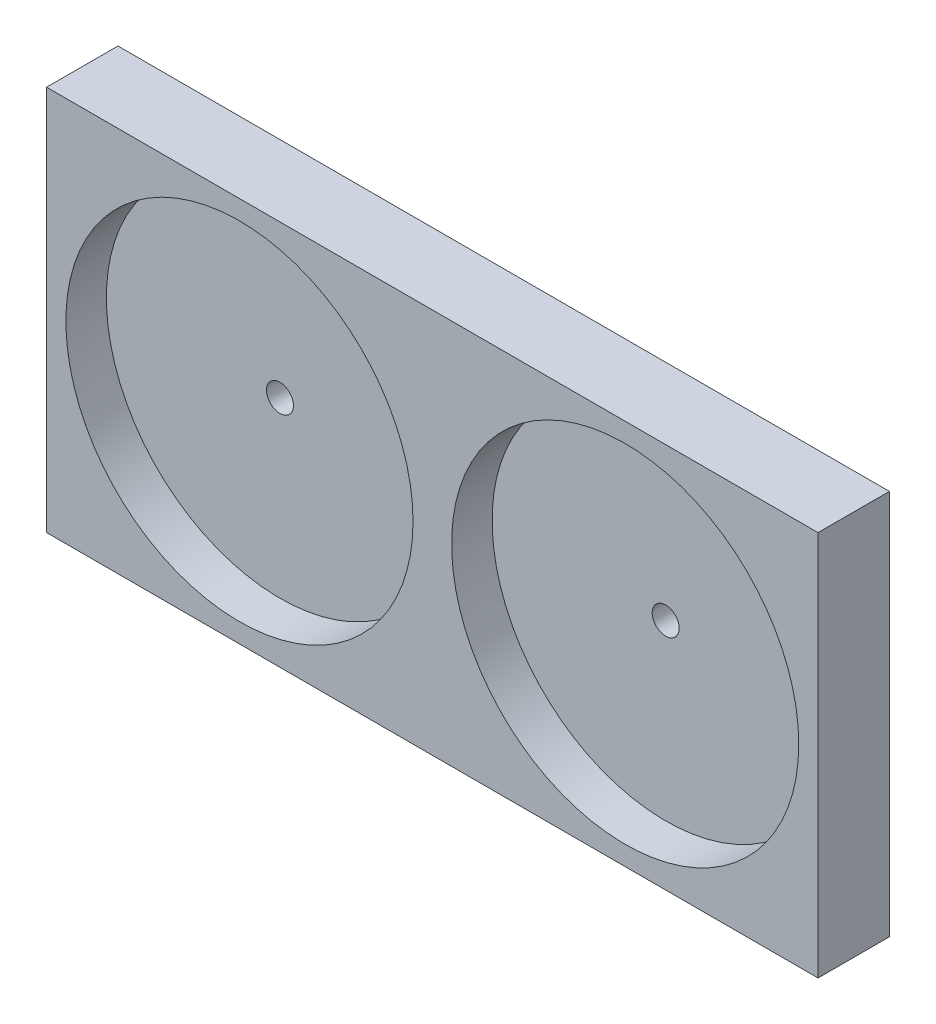
ISO-10303-21;
HEADER;
FILE_DESCRIPTION(('STEP AP214'),'2;1');
FILE_NAME('part.step','',(''),(''),'','','');
FILE_SCHEMA(('AUTOMOTIVE_DESIGN { 1 0 10303 214 1 1 1 1 }'));
ENDSEC;
DATA;
#1=APPLICATION_CONTEXT('core data for automotive mechanical design processes');
#2=APPLICATION_PROTOCOL_DEFINITION('international standard','automotive_design',2000,#1);
#3=PRODUCT_CONTEXT('',#1,'mechanical');
#4=PRODUCT('Part','Part','',(#3));
#5=PRODUCT_RELATED_PRODUCT_CATEGORY('part','',(#4));
#6=PRODUCT_DEFINITION_FORMATION('','',#4);
#7=PRODUCT_DEFINITION_CONTEXT('part definition',#1,'design');
#8=PRODUCT_DEFINITION('design','',#6,#7);
#9=PRODUCT_DEFINITION_SHAPE('','',#8);
#10=(LENGTH_UNIT() NAMED_UNIT(*) SI_UNIT(.MILLI.,.METRE.));
#11=(NAMED_UNIT(*) PLANE_ANGLE_UNIT() SI_UNIT($,.RADIAN.));
#12=(NAMED_UNIT(*) SI_UNIT($,.STERADIAN.) SOLID_ANGLE_UNIT());
#13=UNCERTAINTY_MEASURE_WITH_UNIT(LENGTH_MEASURE(1.E-05),#10,'distance_accuracy_value','');
#14=(GEOMETRIC_REPRESENTATION_CONTEXT(3) GLOBAL_UNCERTAINTY_ASSIGNED_CONTEXT((#13)) GLOBAL_UNIT_ASSIGNED_CONTEXT((#10,
#11,#12)) REPRESENTATION_CONTEXT('',''));
#15=CARTESIAN_POINT('',(0.,0.,0.));
#16=DIRECTION('',(0.,0.,1.));
#17=DIRECTION('',(1.,0.,0.));
#18=AXIS2_PLACEMENT_3D('',#15,#16,#17);
#19=CARTESIAN_POINT('',(0.,0.,0.));
#20=DIRECTION('',(0.,0.,-1.));
#21=DIRECTION('',(-1.,0.,0.));
#22=AXIS2_PLACEMENT_3D('',#19,#20,#21);
#23=PLANE('',#22);
#24=CARTESIAN_POINT('',(150.,50.,0.));
#25=DIRECTION('',(0.,0.,1.));
#26=DIRECTION('',(1.,0.,0.));
#27=AXIS2_PLACEMENT_3D('',#24,#25,#26);
#28=CIRCLE('',#27,3.49999999999999);
#29=CARTESIAN_POINT('',(153.5,50.,0.));
#30=VERTEX_POINT('',#29);
#31=EDGE_CURVE('E355',#30,#30,#28,.T.);
#32=ORIENTED_EDGE('',*,*,#31,.T.);
#33=EDGE_LOOP('',(#32));
#34=FACE_BOUND('',#33,.T.);
#35=DIRECTION('',(0.,1.,0.));
#36=VECTOR('',#35,1.);
#37=CARTESIAN_POINT('',(141.600331897258,55.2961155721941,0.));
#38=LINE('',#37,#36);
#39=CARTESIAN_POINT('',(141.600331897258,25.3942987303045,0.));
#40=VERTEX_POINT('',#39);
#41=CARTESIAN_POINT('',(141.600331897258,55.2961155721941,0.));
#42=VERTEX_POINT('',#41);
#43=EDGE_CURVE('E299',#40,#42,#38,.T.);
#44=ORIENTED_EDGE('',*,*,#43,.T.);
#45=CARTESIAN_POINT('',(150.,55.2961155721941,0.));
#46=DIRECTION('',(0.,0.,-1.));
#47=DIRECTION('',(-1.,0.,0.));
#48=AXIS2_PLACEMENT_3D('',#45,#46,#47);
#49=CIRCLE('',#48,8.39966810274229);
#50=CARTESIAN_POINT('',(158.399668102742,55.2961155721941,0.));
#51=VERTEX_POINT('',#50);
#52=EDGE_CURVE('E309',#42,#51,#49,.T.);
#53=ORIENTED_EDGE('',*,*,#52,.T.);
#54=DIRECTION('',(0.,-1.,0.));
#55=VECTOR('',#54,1.);
#56=CARTESIAN_POINT('',(158.399668102742,55.2961155721941,0.));
#57=LINE('',#56,#55);
#58=CARTESIAN_POINT('',(158.399668102742,25.3942987303045,0.));
#59=VERTEX_POINT('',#58);
#60=EDGE_CURVE('E312',#51,#59,#57,.T.);
#61=ORIENTED_EDGE('',*,*,#60,.T.);
#62=CARTESIAN_POINT('',(150.,25.3942987303045,0.));
#63=DIRECTION('',(0.,0.,-1.));
#64=DIRECTION('',(-1.,0.,0.));
#65=AXIS2_PLACEMENT_3D('',#62,#63,#64);
#66=CIRCLE('',#65,8.39966810274229);
#67=EDGE_CURVE('E316',#59,#40,#66,.T.);
#68=ORIENTED_EDGE('',*,*,#67,.T.);
#69=EDGE_LOOP('',(#44,#53,#61,#68));
#70=FACE_BOUND('',#69,.T.);
#71=ADVANCED_FACE('F39',(#34,#70),#23,.T.);
#72=CARTESIAN_POINT('',(50.,50.,0.));
#73=DIRECTION('',(0.,0.,1.));
#74=DIRECTION('',(1.,0.,0.));
#75=AXIS2_PLACEMENT_3D('',#72,#73,#74);
#76=CIRCLE('',#75,3.5);
#77=CARTESIAN_POINT('',(53.5,50.,0.));
#78=VERTEX_POINT('',#77);
#79=EDGE_CURVE('E425',#78,#78,#76,.T.);
#80=ORIENTED_EDGE('',*,*,#79,.T.);
#81=EDGE_LOOP('',(#80));
#82=FACE_BOUND('',#81,.T.);
#83=DIRECTION('',(0.,1.,0.));
#84=VECTOR('',#83,1.);
#85=CARTESIAN_POINT('',(41.6003318972578,55.2961155721941,0.));
#86=LINE('',#85,#84);
#87=CARTESIAN_POINT('',(41.6003318972578,25.3942987303045,0.));
#88=VERTEX_POINT('',#87);
#89=CARTESIAN_POINT('',(41.6003318972578,55.2961155721941,0.));
#90=VERTEX_POINT('',#89);
#91=EDGE_CURVE('E403',#88,#90,#86,.T.);
#92=ORIENTED_EDGE('',*,*,#91,.T.);
#93=CARTESIAN_POINT('',(50.0000000000001,55.2961155721941,0.));
#94=DIRECTION('',(0.,0.,-1.));
#95=DIRECTION('',(-1.,0.,0.));
#96=AXIS2_PLACEMENT_3D('',#93,#94,#95);
#97=CIRCLE('',#96,8.39966810274229);
#98=CARTESIAN_POINT('',(58.3996681027424,55.2961155721941,0.));
#99=VERTEX_POINT('',#98);
#100=EDGE_CURVE('E313',#90,#99,#97,.T.);
#101=ORIENTED_EDGE('',*,*,#100,.T.);
#102=DIRECTION('',(0.,-1.,0.));
#103=VECTOR('',#102,1.);
#104=CARTESIAN_POINT('',(58.3996681027424,55.2961155721941,0.));
#105=LINE('',#104,#103);
#106=CARTESIAN_POINT('',(58.3996681027424,25.3942987303045,0.));
#107=VERTEX_POINT('',#106);
#108=EDGE_CURVE('E410',#99,#107,#105,.T.);
#109=ORIENTED_EDGE('',*,*,#108,.T.);
#110=CARTESIAN_POINT('',(50.0000000000001,25.3942987303045,0.));
#111=DIRECTION('',(0.,0.,-1.));
#112=DIRECTION('',(-1.,0.,0.));
#113=AXIS2_PLACEMENT_3D('',#110,#111,#112);
#114=CIRCLE('',#113,8.39966810274229);
#115=EDGE_CURVE('E406',#107,#88,#114,.T.);
#116=ORIENTED_EDGE('',*,*,#115,.T.);
#117=EDGE_LOOP('',(#92,#101,#109,#116));
#118=FACE_BOUND('',#117,.T.);
#119=ADVANCED_FACE('F517',(#82,#118),#23,.T.);
#120=CARTESIAN_POINT('',(0.,0.,18.5));
#121=DIRECTION('',(1.,0.,0.));
#122=DIRECTION('',(0.,0.,-1.));
#123=AXIS2_PLACEMENT_3D('',#120,#121,#122);
#124=PLANE('',#123);
#125=DIRECTION('',(0.,-1.,0.));
#126=VECTOR('',#125,1.);
#127=CARTESIAN_POINT('',(0.,0.,0.));
#128=LINE('',#127,#126);
#129=CARTESIAN_POINT('',(0.,100.,0.));
#130=VERTEX_POINT('',#129);
#131=CARTESIAN_POINT('',(0.,0.,0.));
#132=VERTEX_POINT('',#131);
#133=EDGE_CURVE('E434',#130,#132,#128,.T.);
#134=ORIENTED_EDGE('',*,*,#133,.T.);
#135=DIRECTION('',(0.,0.,-1.));
#136=VECTOR('',#135,1.);
#137=CARTESIAN_POINT('',(0.,0.,18.5));
#138=LINE('',#137,#136);
#139=CARTESIAN_POINT('',(0.,0.,18.5));
#140=VERTEX_POINT('',#139);
#141=EDGE_CURVE('E11',#140,#132,#138,.T.);
#142=ORIENTED_EDGE('',*,*,#141,.F.);
#143=DIRECTION('',(0.,-1.,0.));
#144=VECTOR('',#143,1.);
#145=CARTESIAN_POINT('',(0.,0.,18.5));
#146=LINE('',#145,#144);
#147=CARTESIAN_POINT('',(0.,100.,18.5));
#148=VERTEX_POINT('',#147);
#149=EDGE_CURVE('E444',#148,#140,#146,.T.);
#150=ORIENTED_EDGE('',*,*,#149,.F.);
#151=DIRECTION('',(0.,0.,-1.));
#152=VECTOR('',#151,1.);
#153=CARTESIAN_POINT('',(0.,100.,18.5));
#154=LINE('',#153,#152);
#155=EDGE_CURVE('E454',#148,#130,#154,.T.);
#156=ORIENTED_EDGE('',*,*,#155,.T.);
#157=EDGE_LOOP('',(#134,#142,#150,#156));
#158=FACE_BOUND('',#157,.T.);
#159=ADVANCED_FACE('F41',(#158),#124,.F.);
#160=CARTESIAN_POINT('',(0.,0.,18.5));
#161=DIRECTION('',(0.,1.,0.));
#162=DIRECTION('',(0.,0.,1.));
#163=AXIS2_PLACEMENT_3D('',#160,#161,#162);
#164=PLANE('',#163);
#165=DIRECTION('',(1.,0.,0.));
#166=VECTOR('',#165,1.);
#167=CARTESIAN_POINT('',(0.,0.,0.));
#168=LINE('',#167,#166);
#169=CARTESIAN_POINT('',(200.,0.,0.));
#170=VERTEX_POINT('',#169);
#171=EDGE_CURVE('E457',#132,#170,#168,.T.);
#172=ORIENTED_EDGE('',*,*,#171,.T.);
#173=DIRECTION('',(0.,0.,-1.));
#174=VECTOR('',#173,1.);
#175=CARTESIAN_POINT('',(200.,0.,18.5));
#176=LINE('',#175,#174);
#177=CARTESIAN_POINT('',(200.,0.,18.5));
#178=VERTEX_POINT('',#177);
#179=EDGE_CURVE('E48',#178,#170,#176,.T.);
#180=ORIENTED_EDGE('',*,*,#179,.F.);
#181=DIRECTION('',(1.,0.,0.));
#182=VECTOR('',#181,1.);
#183=CARTESIAN_POINT('',(0.,0.,18.5));
#184=LINE('',#183,#182);
#185=EDGE_CURVE('E447',#140,#178,#184,.T.);
#186=ORIENTED_EDGE('',*,*,#185,.F.);
#187=ORIENTED_EDGE('',*,*,#141,.T.);
#188=EDGE_LOOP('',(#172,#180,#186,#187));
#189=FACE_BOUND('',#188,.T.);
#190=ADVANCED_FACE('F505',(#189),#164,.F.);
#191=CARTESIAN_POINT('',(200.,0.,18.5));
#192=DIRECTION('',(-1.,0.,0.));
#193=DIRECTION('',(0.,0.,1.));
#194=AXIS2_PLACEMENT_3D('',#191,#192,#193);
#195=PLANE('',#194);
#196=DIRECTION('',(0.,1.,0.));
#197=VECTOR('',#196,1.);
#198=CARTESIAN_POINT('',(200.,0.,0.));
#199=LINE('',#198,#197);
#200=CARTESIAN_POINT('',(200.,100.,0.));
#201=VERTEX_POINT('',#200);
#202=EDGE_CURVE('E459',#170,#201,#199,.T.);
#203=ORIENTED_EDGE('',*,*,#202,.T.);
#204=DIRECTION('',(0.,0.,-1.));
#205=VECTOR('',#204,1.);
#206=CARTESIAN_POINT('',(200.,100.,18.5));
#207=LINE('',#206,#205);
#208=CARTESIAN_POINT('',(200.,100.,18.5));
#209=VERTEX_POINT('',#208);
#210=EDGE_CURVE('E464',#209,#201,#207,.T.);
#211=ORIENTED_EDGE('',*,*,#210,.F.);
#212=DIRECTION('',(0.,1.,0.));
#213=VECTOR('',#212,1.);
#214=CARTESIAN_POINT('',(200.,0.,18.5));
#215=LINE('',#214,#213);
#216=EDGE_CURVE('E450',#178,#209,#215,.T.);
#217=ORIENTED_EDGE('',*,*,#216,.F.);
#218=ORIENTED_EDGE('',*,*,#179,.T.);
#219=EDGE_LOOP('',(#203,#211,#217,#218));
#220=FACE_BOUND('',#219,.T.);
#221=ADVANCED_FACE('F510',(#220),#195,.F.);
#222=CARTESIAN_POINT('',(0.,100.,18.5));
#223=DIRECTION('',(0.,-1.,0.));
#224=DIRECTION('',(0.,0.,-1.));
#225=AXIS2_PLACEMENT_3D('',#222,#223,#224);
#226=PLANE('',#225);
#227=DIRECTION('',(-1.,0.,0.));
#228=VECTOR('',#227,1.);
#229=CARTESIAN_POINT('',(0.,100.,0.));
#230=LINE('',#229,#228);
#231=EDGE_CURVE('E448',#201,#130,#230,.T.);
#232=ORIENTED_EDGE('',*,*,#231,.T.);
#233=ORIENTED_EDGE('',*,*,#155,.F.);
#234=DIRECTION('',(-1.,0.,0.));
#235=VECTOR('',#234,1.);
#236=CARTESIAN_POINT('',(0.,100.,18.5));
#237=LINE('',#236,#235);
#238=EDGE_CURVE('E452',#209,#148,#237,.T.);
#239=ORIENTED_EDGE('',*,*,#238,.F.);
#240=ORIENTED_EDGE('',*,*,#210,.T.);
#241=EDGE_LOOP('',(#232,#233,#239,#240));
#242=FACE_BOUND('',#241,.T.);
#243=ADVANCED_FACE('F494',(#242),#226,.F.);
#244=CARTESIAN_POINT('',(0.,0.,18.5));
#245=DIRECTION('',(0.,0.,-1.));
#246=DIRECTION('',(-1.,0.,0.));
#247=AXIS2_PLACEMENT_3D('',#244,#245,#246);
#248=PLANE('',#247);
#249=CARTESIAN_POINT('',(50.,50.,18.5));
#250=DIRECTION('',(0.,0.,1.));
#251=DIRECTION('',(1.,0.,0.));
#252=AXIS2_PLACEMENT_3D('',#249,#250,#251);
#253=CIRCLE('',#252,45.);
#254=CARTESIAN_POINT('',(95.,50.,18.5));
#255=VERTEX_POINT('',#254);
#256=EDGE_CURVE('E435',#255,#255,#253,.T.);
#257=ORIENTED_EDGE('',*,*,#256,.F.);
#258=EDGE_LOOP('',(#257));
#259=FACE_BOUND('',#258,.T.);
#260=CARTESIAN_POINT('',(150.,50.,18.5));
#261=DIRECTION('',(0.,0.,1.));
#262=DIRECTION('',(1.,0.,0.));
#263=AXIS2_PLACEMENT_3D('',#260,#261,#262);
#264=CIRCLE('',#263,45.);
#265=CARTESIAN_POINT('',(195.,50.,18.5));
#266=VERTEX_POINT('',#265);
#267=EDGE_CURVE('E438',#266,#266,#264,.T.);
#268=ORIENTED_EDGE('',*,*,#267,.F.);
#269=EDGE_LOOP('',(#268));
#270=FACE_BOUND('',#269,.T.);
#271=ORIENTED_EDGE('',*,*,#149,.T.);
#272=ORIENTED_EDGE('',*,*,#185,.T.);
#273=ORIENTED_EDGE('',*,*,#216,.T.);
#274=ORIENTED_EDGE('',*,*,#238,.T.);
#275=EDGE_LOOP('',(#271,#272,#273,#274));
#276=FACE_BOUND('',#275,.T.);
#277=ADVANCED_FACE('F491',(#259,#270,#276),#248,.F.);
#278=CARTESIAN_POINT('',(110.1200005,30.2499995,0.));
#279=DIRECTION('',(0.,0.,-1.));
#280=DIRECTION('',(-1.,0.,0.));
#281=AXIS2_PLACEMENT_3D('',#278,#279,#280);
#282=CIRCLE('',#281,2.);
#283=CARTESIAN_POINT('',(110.1200005,32.2499995,0.));
#284=VERTEX_POINT('',#283);
#285=CARTESIAN_POINT('',(110.1200005,28.2499995,0.));
#286=VERTEX_POINT('',#285);
#287=EDGE_CURVE('E56',#284,#286,#282,.T.);
#288=ORIENTED_EDGE('',*,*,#287,.F.);
#289=DIRECTION('',(1.,0.,0.));
#290=VECTOR('',#289,1.);
#291=CARTESIAN_POINT('',(110.1200005,32.2499995,0.));
#292=LINE('',#291,#290);
#293=CARTESIAN_POINT('',(89.8000005000001,32.2499995,0.));
#294=VERTEX_POINT('',#293);
#295=EDGE_CURVE('E246',#294,#284,#292,.T.);
#296=ORIENTED_EDGE('',*,*,#295,.F.);
#297=CARTESIAN_POINT('',(89.8000005000001,30.2499995,0.));
#298=DIRECTION('',(0.,0.,-1.));
#299=DIRECTION('',(-1.,0.,0.));
#300=AXIS2_PLACEMENT_3D('',#297,#298,#299);
#301=CIRCLE('',#300,2.);
#302=CARTESIAN_POINT('',(89.8000005000001,28.2499995,0.));
#303=VERTEX_POINT('',#302);
#304=EDGE_CURVE('E249',#303,#294,#301,.T.);
#305=ORIENTED_EDGE('',*,*,#304,.F.);
#306=DIRECTION('',(-1.,0.,0.));
#307=VECTOR('',#306,1.);
#308=CARTESIAN_POINT('',(110.1200005,28.2499995,0.));
#309=LINE('',#308,#307);
#310=EDGE_CURVE('E255',#286,#303,#309,.T.);
#311=ORIENTED_EDGE('',*,*,#310,.F.);
#312=EDGE_LOOP('',(#288,#296,#305,#311));
#313=FACE_BOUND('',#312,.T.);
#314=CARTESIAN_POINT('',(110.1200005,14.9999995,0.));
#315=DIRECTION('',(0.,0.,-1.));
#316=DIRECTION('',(-1.,0.,0.));
#317=AXIS2_PLACEMENT_3D('',#314,#315,#316);
#318=CIRCLE('',#317,2.);
#319=CARTESIAN_POINT('',(110.1200005,16.9999995,0.));
#320=VERTEX_POINT('',#319);
#321=CARTESIAN_POINT('',(110.1200005,12.9999995,0.));
#322=VERTEX_POINT('',#321);
#323=EDGE_CURVE('E64',#320,#322,#318,.T.);
#324=ORIENTED_EDGE('',*,*,#323,.F.);
#325=DIRECTION('',(1.,0.,0.));
#326=VECTOR('',#325,1.);
#327=CARTESIAN_POINT('',(110.1200005,16.9999995,0.));
#328=LINE('',#327,#326);
#329=CARTESIAN_POINT('',(89.8000005000001,16.9999995,0.));
#330=VERTEX_POINT('',#329);
#331=EDGE_CURVE('E274',#330,#320,#328,.T.);
#332=ORIENTED_EDGE('',*,*,#331,.F.);
#333=CARTESIAN_POINT('',(89.8000005000001,14.9999995,0.));
#334=DIRECTION('',(0.,0.,-1.));
#335=DIRECTION('',(-1.,0.,0.));
#336=AXIS2_PLACEMENT_3D('',#333,#334,#335);
#337=CIRCLE('',#336,2.);
#338=CARTESIAN_POINT('',(89.8000005000001,12.9999995,0.));
#339=VERTEX_POINT('',#338);
#340=EDGE_CURVE('E277',#339,#330,#337,.T.);
#341=ORIENTED_EDGE('',*,*,#340,.F.);
#342=DIRECTION('',(-1.,0.,0.));
#343=VECTOR('',#342,1.);
#344=CARTESIAN_POINT('',(110.1200005,12.9999995,0.));
#345=LINE('',#344,#343);
#346=EDGE_CURVE('E281',#322,#339,#345,.T.);
#347=ORIENTED_EDGE('',*,*,#346,.F.);
#348=EDGE_LOOP('',(#324,#332,#341,#347));
#349=FACE_BOUND('',#348,.T.);
#350=CARTESIAN_POINT('',(150.,55.2961155721941,0.));
#351=DIRECTION('',(0.,0.,-1.));
#352=DIRECTION('',(-1.,0.,0.));
#353=AXIS2_PLACEMENT_3D('',#350,#351,#352);
#354=CIRCLE('',#353,16.3996681027423);
#355=CARTESIAN_POINT('',(133.600331897258,55.2961155721941,0.));
#356=VERTEX_POINT('',#355);
#357=CARTESIAN_POINT('',(166.399668102742,55.2961155721941,0.));
#358=VERTEX_POINT('',#357);
#359=EDGE_CURVE('E323',#356,#358,#354,.T.);
#360=ORIENTED_EDGE('',*,*,#359,.F.);
#361=DIRECTION('',(0.,1.,0.));
#362=VECTOR('',#361,1.);
#363=CARTESIAN_POINT('',(133.600331897258,55.2961155721941,0.));
#364=LINE('',#363,#362);
#365=CARTESIAN_POINT('',(133.600331897258,25.3942987303045,0.));
#366=VERTEX_POINT('',#365);
#367=EDGE_CURVE('E334',#366,#356,#364,.T.);
#368=ORIENTED_EDGE('',*,*,#367,.F.);
#369=CARTESIAN_POINT('',(150.,25.3942987303045,0.));
#370=DIRECTION('',(0.,0.,-1.));
#371=DIRECTION('',(-1.,0.,0.));
#372=AXIS2_PLACEMENT_3D('',#369,#370,#371);
#373=CIRCLE('',#372,16.3996681027423);
#374=CARTESIAN_POINT('',(166.399668102742,25.3942987303045,0.));
#375=VERTEX_POINT('',#374);
#376=EDGE_CURVE('E348',#375,#366,#373,.T.);
#377=ORIENTED_EDGE('',*,*,#376,.F.);
#378=DIRECTION('',(0.,-1.,0.));
#379=VECTOR('',#378,1.);
#380=CARTESIAN_POINT('',(166.399668102742,55.2961155721941,0.));
#381=LINE('',#380,#379);
#382=EDGE_CURVE('E345',#358,#375,#381,.T.);
#383=ORIENTED_EDGE('',*,*,#382,.F.);
#384=EDGE_LOOP('',(#360,#368,#377,#383));
#385=FACE_BOUND('',#384,.T.);
#386=CARTESIAN_POINT('',(50.0000000000001,55.2961155721941,0.));
#387=DIRECTION('',(0.,0.,-1.));
#388=DIRECTION('',(-1.,0.,0.));
#389=AXIS2_PLACEMENT_3D('',#386,#387,#388);
#390=CIRCLE('',#389,16.3996681027423);
#391=CARTESIAN_POINT('',(33.6003318972578,55.2961155721941,0.));
#392=VERTEX_POINT('',#391);
#393=CARTESIAN_POINT('',(66.3996681027424,55.2961155721941,0.));
#394=VERTEX_POINT('',#393);
#395=EDGE_CURVE('E381',#392,#394,#390,.T.);
#396=ORIENTED_EDGE('',*,*,#395,.F.);
#397=DIRECTION('',(0.,1.,0.));
#398=VECTOR('',#397,1.);
#399=CARTESIAN_POINT('',(33.6003318972578,55.2961155721941,0.));
#400=LINE('',#399,#398);
#401=CARTESIAN_POINT('',(33.6003318972578,25.3942987303045,0.));
#402=VERTEX_POINT('',#401);
#403=EDGE_CURVE('E371',#402,#392,#400,.T.);
#404=ORIENTED_EDGE('',*,*,#403,.F.);
#405=CARTESIAN_POINT('',(50.0000000000001,25.3942987303045,0.));
#406=DIRECTION('',(0.,0.,-1.));
#407=DIRECTION('',(-1.,0.,0.));
#408=AXIS2_PLACEMENT_3D('',#405,#406,#407);
#409=CIRCLE('',#408,16.3996681027423);
#410=CARTESIAN_POINT('',(66.3996681027424,25.3942987303045,0.));
#411=VERTEX_POINT('',#410);
#412=EDGE_CURVE('E374',#411,#402,#409,.T.);
#413=ORIENTED_EDGE('',*,*,#412,.F.);
#414=DIRECTION('',(0.,-1.,0.));
#415=VECTOR('',#414,1.);
#416=CARTESIAN_POINT('',(66.3996681027424,55.2961155721941,0.));
#417=LINE('',#416,#415);
#418=EDGE_CURVE('E378',#394,#411,#417,.T.);
#419=ORIENTED_EDGE('',*,*,#418,.F.);
#420=EDGE_LOOP('',(#396,#404,#413,#419));
#421=FACE_BOUND('',#420,.T.);
#422=ORIENTED_EDGE('',*,*,#133,.F.);
#423=ORIENTED_EDGE('',*,*,#231,.F.);
#424=ORIENTED_EDGE('',*,*,#202,.F.);
#425=ORIENTED_EDGE('',*,*,#171,.F.);
#426=EDGE_LOOP('',(#422,#423,#424,#425));
#427=FACE_BOUND('',#426,.T.);
#428=ADVANCED_FACE('F487',(#313,#349,#385,#421,#427),#23,.T.);
#429=CARTESIAN_POINT('',(150.,50.,8.));
#430=DIRECTION('',(0.,0.,1.));
#431=DIRECTION('',(1.,0.,0.));
#432=AXIS2_PLACEMENT_3D('',#429,#430,#431);
#433=CYLINDRICAL_SURFACE('',#432,45.);
#434=CARTESIAN_POINT('',(150.,50.,8.));
#435=DIRECTION('',(0.,0.,1.));
#436=DIRECTION('',(1.,0.,0.));
#437=AXIS2_PLACEMENT_3D('',#434,#435,#436);
#438=CIRCLE('',#437,45.);
#439=CARTESIAN_POINT('',(195.,50.,8.));
#440=VERTEX_POINT('',#439);
#441=EDGE_CURVE('E441',#440,#440,#438,.T.);
#442=ORIENTED_EDGE('',*,*,#441,.F.);
#443=EDGE_LOOP('',(#442));
#444=FACE_BOUND('',#443,.T.);
#445=ORIENTED_EDGE('',*,*,#267,.T.);
#446=EDGE_LOOP('',(#445));
#447=FACE_BOUND('',#446,.T.);
#448=ADVANCED_FACE('F481',(#444,#447),#433,.F.);
#449=CARTESIAN_POINT('',(150.,50.,8.));
#450=DIRECTION('',(0.,0.,1.));
#451=DIRECTION('',(1.,0.,0.));
#452=AXIS2_PLACEMENT_3D('',#449,#450,#451);
#453=PLANE('',#452);
#454=CARTESIAN_POINT('',(150.,50.,8.));
#455=DIRECTION('',(0.,0.,1.));
#456=DIRECTION('',(1.,0.,0.));
#457=AXIS2_PLACEMENT_3D('',#454,#455,#456);
#458=CIRCLE('',#457,3.49999999999999);
#459=CARTESIAN_POINT('',(153.5,50.,8.));
#460=VERTEX_POINT('',#459);
#461=EDGE_CURVE('E43',#460,#460,#458,.T.);
#462=ORIENTED_EDGE('',*,*,#461,.F.);
#463=EDGE_LOOP('',(#462));
#464=FACE_BOUND('',#463,.T.);
#465=ORIENTED_EDGE('',*,*,#441,.T.);
#466=EDGE_LOOP('',(#465));
#467=FACE_BOUND('',#466,.T.);
#468=ADVANCED_FACE('F477',(#464,#467),#453,.T.);
#469=CARTESIAN_POINT('',(50.,50.,8.));
#470=DIRECTION('',(0.,0.,1.));
#471=DIRECTION('',(1.,0.,0.));
#472=AXIS2_PLACEMENT_3D('',#469,#470,#471);
#473=CYLINDRICAL_SURFACE('',#472,45.);
#474=CARTESIAN_POINT('',(50.,50.,8.));
#475=DIRECTION('',(0.,0.,1.));
#476=DIRECTION('',(1.,0.,0.));
#477=AXIS2_PLACEMENT_3D('',#474,#475,#476);
#478=CIRCLE('',#477,45.);
#479=CARTESIAN_POINT('',(95.,50.,8.));
#480=VERTEX_POINT('',#479);
#481=EDGE_CURVE('E431',#480,#480,#478,.T.);
#482=ORIENTED_EDGE('',*,*,#481,.F.);
#483=EDGE_LOOP('',(#482));
#484=FACE_BOUND('',#483,.T.);
#485=ORIENTED_EDGE('',*,*,#256,.T.);
#486=EDGE_LOOP('',(#485));
#487=FACE_BOUND('',#486,.T.);
#488=ADVANCED_FACE('F480',(#484,#487),#473,.F.);
#489=CARTESIAN_POINT('',(50.,50.,8.));
#490=DIRECTION('',(0.,0.,1.));
#491=DIRECTION('',(1.,0.,0.));
#492=AXIS2_PLACEMENT_3D('',#489,#490,#491);
#493=PLANE('',#492);
#494=CARTESIAN_POINT('',(50.,50.,8.));
#495=DIRECTION('',(0.,0.,1.));
#496=DIRECTION('',(1.,0.,0.));
#497=AXIS2_PLACEMENT_3D('',#494,#495,#496);
#498=CIRCLE('',#497,3.5);
#499=CARTESIAN_POINT('',(53.5,50.,8.));
#500=VERTEX_POINT('',#499);
#501=EDGE_CURVE('E428',#500,#500,#498,.T.);
#502=ORIENTED_EDGE('',*,*,#501,.F.);
#503=EDGE_LOOP('',(#502));
#504=FACE_BOUND('',#503,.T.);
#505=ORIENTED_EDGE('',*,*,#481,.T.);
#506=EDGE_LOOP('',(#505));
#507=FACE_BOUND('',#506,.T.);
#508=ADVANCED_FACE('F592',(#504,#507),#493,.T.);
#509=CARTESIAN_POINT('',(50.,50.,0.));
#510=DIRECTION('',(0.,0.,1.));
#511=DIRECTION('',(1.,0.,0.));
#512=AXIS2_PLACEMENT_3D('',#509,#510,#511);
#513=CYLINDRICAL_SURFACE('',#512,3.5);
#514=ORIENTED_EDGE('',*,*,#501,.T.);
#515=EDGE_LOOP('',(#514));
#516=FACE_BOUND('',#515,.T.);
#517=ORIENTED_EDGE('',*,*,#79,.F.);
#518=EDGE_LOOP('',(#517));
#519=FACE_BOUND('',#518,.T.);
#520=ADVANCED_FACE('F589',(#516,#519),#513,.F.);
#521=CARTESIAN_POINT('',(150.,50.,0.));
#522=DIRECTION('',(0.,0.,1.));
#523=DIRECTION('',(1.,0.,0.));
#524=AXIS2_PLACEMENT_3D('',#521,#522,#523);
#525=CYLINDRICAL_SURFACE('',#524,3.49999999999999);
#526=ORIENTED_EDGE('',*,*,#461,.T.);
#527=EDGE_LOOP('',(#526));
#528=FACE_BOUND('',#527,.T.);
#529=ORIENTED_EDGE('',*,*,#31,.F.);
#530=EDGE_LOOP('',(#529));
#531=FACE_BOUND('',#530,.T.);
#532=ADVANCED_FACE('F474',(#528,#531),#525,.F.);
#533=CARTESIAN_POINT('',(50.0000000000001,55.2961155721941,3.));
#534=DIRECTION('',(0.,0.,-1.));
#535=DIRECTION('',(-1.,0.,0.));
#536=AXIS2_PLACEMENT_3D('',#533,#534,#535);
#537=CYLINDRICAL_SURFACE('',#536,16.3996681027423);
#538=ORIENTED_EDGE('',*,*,#395,.T.);
#539=DIRECTION('',(0.,0.,-1.));
#540=VECTOR('',#539,1.);
#541=CARTESIAN_POINT('',(66.3996681027424,55.2961155721941,3.));
#542=LINE('',#541,#540);
#543=CARTESIAN_POINT('',(66.3996681027424,55.2961155721941,3.));
#544=VERTEX_POINT('',#543);
#545=EDGE_CURVE('E362',#544,#394,#542,.T.);
#546=ORIENTED_EDGE('',*,*,#545,.F.);
#547=CARTESIAN_POINT('',(50.0000000000001,55.2961155721941,3.));
#548=DIRECTION('',(0.,0.,-1.));
#549=DIRECTION('',(-1.,0.,0.));
#550=AXIS2_PLACEMENT_3D('',#547,#548,#549);
#551=CIRCLE('',#550,16.3996681027423);
#552=CARTESIAN_POINT('',(33.6003318972578,55.2961155721941,3.));
#553=VERTEX_POINT('',#552);
#554=EDGE_CURVE('E375',#553,#544,#551,.T.);
#555=ORIENTED_EDGE('',*,*,#554,.F.);
#556=DIRECTION('',(0.,0.,-1.));
#557=VECTOR('',#556,1.);
#558=CARTESIAN_POINT('',(33.6003318972578,55.2961155721941,3.));
#559=LINE('',#558,#557);
#560=EDGE_CURVE('E261',#553,#392,#559,.T.);
#561=ORIENTED_EDGE('',*,*,#560,.T.);
#562=EDGE_LOOP('',(#538,#546,#555,#561));
#563=FACE_BOUND('',#562,.T.);
#564=ADVANCED_FACE('F559',(#563),#537,.F.);
#565=CARTESIAN_POINT('',(33.6003318972578,55.2961155721941,3.));
#566=DIRECTION('',(-1.,0.,0.));
#567=DIRECTION('',(0.,0.,1.));
#568=AXIS2_PLACEMENT_3D('',#565,#566,#567);
#569=PLANE('',#568);
#570=ORIENTED_EDGE('',*,*,#403,.T.);
#571=ORIENTED_EDGE('',*,*,#560,.F.);
#572=DIRECTION('',(0.,1.,0.));
#573=VECTOR('',#572,1.);
#574=CARTESIAN_POINT('',(33.6003318972578,55.2961155721941,3.));
#575=LINE('',#574,#573);
#576=CARTESIAN_POINT('',(33.6003318972578,25.3942987303045,3.));
#577=VERTEX_POINT('',#576);
#578=EDGE_CURVE('E365',#577,#553,#575,.T.);
#579=ORIENTED_EDGE('',*,*,#578,.F.);
#580=DIRECTION('',(0.,0.,-1.));
#581=VECTOR('',#580,1.);
#582=CARTESIAN_POINT('',(33.6003318972578,25.3942987303045,3.));
#583=LINE('',#582,#581);
#584=EDGE_CURVE('E368',#577,#402,#583,.T.);
#585=ORIENTED_EDGE('',*,*,#584,.T.);
#586=EDGE_LOOP('',(#570,#571,#579,#585));
#587=FACE_BOUND('',#586,.T.);
#588=ADVANCED_FACE('F568',(#587),#569,.F.);
#589=CARTESIAN_POINT('',(50.0000000000001,25.3942987303045,3.));
#590=DIRECTION('',(0.,0.,-1.));
#591=DIRECTION('',(-1.,0.,0.));
#592=AXIS2_PLACEMENT_3D('',#589,#590,#591);
#593=CYLINDRICAL_SURFACE('',#592,16.3996681027423);
#594=ORIENTED_EDGE('',*,*,#412,.T.);
#595=ORIENTED_EDGE('',*,*,#584,.F.);
#596=CARTESIAN_POINT('',(50.0000000000001,25.3942987303045,3.));
#597=DIRECTION('',(0.,0.,-1.));
#598=DIRECTION('',(-1.,0.,0.));
#599=AXIS2_PLACEMENT_3D('',#596,#597,#598);
#600=CIRCLE('',#599,16.3996681027423);
#601=CARTESIAN_POINT('',(66.3996681027424,25.3942987303045,3.));
#602=VERTEX_POINT('',#601);
#603=EDGE_CURVE('E386',#602,#577,#600,.T.);
#604=ORIENTED_EDGE('',*,*,#603,.F.);
#605=DIRECTION('',(0.,0.,-1.));
#606=VECTOR('',#605,1.);
#607=CARTESIAN_POINT('',(66.3996681027424,25.3942987303045,3.));
#608=LINE('',#607,#606);
#609=EDGE_CURVE('E366',#602,#411,#608,.T.);
#610=ORIENTED_EDGE('',*,*,#609,.T.);
#611=EDGE_LOOP('',(#594,#595,#604,#610));
#612=FACE_BOUND('',#611,.T.);
#613=ADVANCED_FACE('F566',(#612),#593,.F.);
#614=CARTESIAN_POINT('',(66.3996681027424,55.2961155721941,3.));
#615=DIRECTION('',(1.,0.,0.));
#616=DIRECTION('',(0.,0.,-1.));
#617=AXIS2_PLACEMENT_3D('',#614,#615,#616);
#618=PLANE('',#617);
#619=ORIENTED_EDGE('',*,*,#418,.T.);
#620=ORIENTED_EDGE('',*,*,#609,.F.);
#621=DIRECTION('',(0.,-1.,0.));
#622=VECTOR('',#621,1.);
#623=CARTESIAN_POINT('',(66.3996681027424,55.2961155721941,3.));
#624=LINE('',#623,#622);
#625=EDGE_CURVE('E389',#544,#602,#624,.T.);
#626=ORIENTED_EDGE('',*,*,#625,.F.);
#627=ORIENTED_EDGE('',*,*,#545,.T.);
#628=EDGE_LOOP('',(#619,#620,#626,#627));
#629=FACE_BOUND('',#628,.T.);
#630=ADVANCED_FACE('F553',(#629),#618,.F.);
#631=CARTESIAN_POINT('',(50.0000000000001,55.2961155721941,3.));
#632=DIRECTION('',(0.,0.,-1.));
#633=DIRECTION('',(-1.,0.,0.));
#634=AXIS2_PLACEMENT_3D('',#631,#632,#633);
#635=PLANE('',#634);
#636=DIRECTION('',(0.,1.,0.));
#637=VECTOR('',#636,1.);
#638=CARTESIAN_POINT('',(41.6003318972578,55.2961155721941,3.));
#639=LINE('',#638,#637);
#640=CARTESIAN_POINT('',(41.6003318972578,25.3942987303045,3.));
#641=VERTEX_POINT('',#640);
#642=CARTESIAN_POINT('',(41.6003318972578,55.2961155721941,3.));
#643=VERTEX_POINT('',#642);
#644=EDGE_CURVE('E396',#641,#643,#639,.T.);
#645=ORIENTED_EDGE('',*,*,#644,.F.);
#646=CARTESIAN_POINT('',(50.0000000000001,25.3942987303045,3.));
#647=DIRECTION('',(0.,0.,-1.));
#648=DIRECTION('',(-1.,0.,0.));
#649=AXIS2_PLACEMENT_3D('',#646,#647,#648);
#650=CIRCLE('',#649,8.39966810274229);
#651=CARTESIAN_POINT('',(58.3996681027424,25.3942987303045,3.));
#652=VERTEX_POINT('',#651);
#653=EDGE_CURVE('E417',#652,#641,#650,.T.);
#654=ORIENTED_EDGE('',*,*,#653,.F.);
#655=DIRECTION('',(0.,-1.,0.));
#656=VECTOR('',#655,1.);
#657=CARTESIAN_POINT('',(58.3996681027424,55.2961155721941,3.));
#658=LINE('',#657,#656);
#659=CARTESIAN_POINT('',(58.3996681027424,55.2961155721941,3.));
#660=VERTEX_POINT('',#659);
#661=EDGE_CURVE('E420',#660,#652,#658,.T.);
#662=ORIENTED_EDGE('',*,*,#661,.F.);
#663=CARTESIAN_POINT('',(50.0000000000001,55.2961155721941,3.));
#664=DIRECTION('',(0.,0.,-1.));
#665=DIRECTION('',(-1.,0.,0.));
#666=AXIS2_PLACEMENT_3D('',#663,#664,#665);
#667=CIRCLE('',#666,8.39966810274229);
#668=EDGE_CURVE('E407',#643,#660,#667,.T.);
#669=ORIENTED_EDGE('',*,*,#668,.F.);
#670=EDGE_LOOP('',(#645,#654,#662,#669));
#671=FACE_BOUND('',#670,.T.);
#672=ORIENTED_EDGE('',*,*,#554,.T.);
#673=ORIENTED_EDGE('',*,*,#625,.T.);
#674=ORIENTED_EDGE('',*,*,#603,.T.);
#675=ORIENTED_EDGE('',*,*,#578,.T.);
#676=EDGE_LOOP('',(#672,#673,#674,#675));
#677=FACE_BOUND('',#676,.T.);
#678=ADVANCED_FACE('F550',(#671,#677),#635,.T.);
#679=CARTESIAN_POINT('',(50.0000000000001,55.2961155721941,3.));
#680=DIRECTION('',(0.,0.,-1.));
#681=DIRECTION('',(-1.,0.,0.));
#682=AXIS2_PLACEMENT_3D('',#679,#680,#681);
#683=CYLINDRICAL_SURFACE('',#682,8.39966810274229);
#684=ORIENTED_EDGE('',*,*,#100,.F.);
#685=DIRECTION('',(0.,0.,-1.));
#686=VECTOR('',#685,1.);
#687=CARTESIAN_POINT('',(41.6003318972578,55.2961155721941,3.));
#688=LINE('',#687,#686);
#689=EDGE_CURVE('E383',#643,#90,#688,.T.);
#690=ORIENTED_EDGE('',*,*,#689,.F.);
#691=ORIENTED_EDGE('',*,*,#668,.T.);
#692=DIRECTION('',(0.,0.,-1.));
#693=VECTOR('',#692,1.);
#694=CARTESIAN_POINT('',(58.3996681027424,55.2961155721941,3.));
#695=LINE('',#694,#693);
#696=EDGE_CURVE('E394',#660,#99,#695,.T.);
#697=ORIENTED_EDGE('',*,*,#696,.T.);
#698=EDGE_LOOP('',(#684,#690,#691,#697));
#699=FACE_BOUND('',#698,.T.);
#700=ADVANCED_FACE('F541',(#699),#683,.T.);
#701=CARTESIAN_POINT('',(41.6003318972578,55.2961155721941,3.));
#702=DIRECTION('',(-1.,0.,0.));
#703=DIRECTION('',(0.,-1.,0.));
#704=AXIS2_PLACEMENT_3D('',#701,#702,#703);
#705=PLANE('',#704);
#706=ORIENTED_EDGE('',*,*,#91,.F.);
#707=DIRECTION('',(0.,0.,-1.));
#708=VECTOR('',#707,1.);
#709=CARTESIAN_POINT('',(41.6003318972578,25.3942987303045,3.));
#710=LINE('',#709,#708);
#711=EDGE_CURVE('E400',#641,#88,#710,.T.);
#712=ORIENTED_EDGE('',*,*,#711,.F.);
#713=ORIENTED_EDGE('',*,*,#644,.T.);
#714=ORIENTED_EDGE('',*,*,#689,.T.);
#715=EDGE_LOOP('',(#706,#712,#713,#714));
#716=FACE_BOUND('',#715,.T.);
#717=ADVANCED_FACE('F537',(#716),#705,.T.);
#718=CARTESIAN_POINT('',(50.0000000000001,25.3942987303045,3.));
#719=DIRECTION('',(0.,0.,-1.));
#720=DIRECTION('',(-1.,0.,0.));
#721=AXIS2_PLACEMENT_3D('',#718,#719,#720);
#722=CYLINDRICAL_SURFACE('',#721,8.39966810274229);
#723=ORIENTED_EDGE('',*,*,#115,.F.);
#724=DIRECTION('',(0.,0.,-1.));
#725=VECTOR('',#724,1.);
#726=CARTESIAN_POINT('',(58.3996681027424,25.3942987303045,3.));
#727=LINE('',#726,#725);
#728=EDGE_CURVE('E397',#652,#107,#727,.T.);
#729=ORIENTED_EDGE('',*,*,#728,.F.);
#730=ORIENTED_EDGE('',*,*,#653,.T.);
#731=ORIENTED_EDGE('',*,*,#711,.T.);
#732=EDGE_LOOP('',(#723,#729,#730,#731));
#733=FACE_BOUND('',#732,.T.);
#734=ADVANCED_FACE('F548',(#733),#722,.T.);
#735=CARTESIAN_POINT('',(58.3996681027424,55.2961155721941,3.));
#736=DIRECTION('',(1.,0.,0.));
#737=DIRECTION('',(0.,1.,0.));
#738=AXIS2_PLACEMENT_3D('',#735,#736,#737);
#739=PLANE('',#738);
#740=ORIENTED_EDGE('',*,*,#108,.F.);
#741=ORIENTED_EDGE('',*,*,#696,.F.);
#742=ORIENTED_EDGE('',*,*,#661,.T.);
#743=ORIENTED_EDGE('',*,*,#728,.T.);
#744=EDGE_LOOP('',(#740,#741,#742,#743));
#745=FACE_BOUND('',#744,.T.);
#746=ADVANCED_FACE('F545',(#745),#739,.T.);
#747=CARTESIAN_POINT('',(150.,55.2961155721941,3.));
#748=DIRECTION('',(0.,0.,-1.));
#749=DIRECTION('',(-1.,0.,0.));
#750=AXIS2_PLACEMENT_3D('',#747,#748,#749);
#751=CYLINDRICAL_SURFACE('',#750,16.3996681027423);
#752=ORIENTED_EDGE('',*,*,#359,.T.);
#753=DIRECTION('',(0.,0.,-1.));
#754=VECTOR('',#753,1.);
#755=CARTESIAN_POINT('',(166.399668102742,55.2961155721941,3.));
#756=LINE('',#755,#754);
#757=CARTESIAN_POINT('',(166.399668102742,55.2961155721941,3.));
#758=VERTEX_POINT('',#757);
#759=EDGE_CURVE('E343',#758,#358,#756,.T.);
#760=ORIENTED_EDGE('',*,*,#759,.F.);
#761=CARTESIAN_POINT('',(150.,55.2961155721941,3.));
#762=DIRECTION('',(0.,0.,-1.));
#763=DIRECTION('',(-1.,0.,0.));
#764=AXIS2_PLACEMENT_3D('',#761,#762,#763);
#765=CIRCLE('',#764,16.3996681027423);
#766=CARTESIAN_POINT('',(133.600331897258,55.2961155721941,3.));
#767=VERTEX_POINT('',#766);
#768=EDGE_CURVE('E330',#767,#758,#765,.T.);
#769=ORIENTED_EDGE('',*,*,#768,.F.);
#770=DIRECTION('',(0.,0.,-1.));
#771=VECTOR('',#770,1.);
#772=CARTESIAN_POINT('',(133.600331897258,55.2961155721941,3.));
#773=LINE('',#772,#771);
#774=EDGE_CURVE('E353',#767,#356,#773,.T.);
#775=ORIENTED_EDGE('',*,*,#774,.T.);
#776=EDGE_LOOP('',(#752,#760,#769,#775));
#777=FACE_BOUND('',#776,.T.);
#778=ADVANCED_FACE('F584',(#777),#751,.F.);
#779=CARTESIAN_POINT('',(133.600331897258,55.2961155721941,3.));
#780=DIRECTION('',(-1.,0.,0.));
#781=DIRECTION('',(0.,0.,1.));
#782=AXIS2_PLACEMENT_3D('',#779,#780,#781);
#783=PLANE('',#782);
#784=ORIENTED_EDGE('',*,*,#367,.T.);
#785=ORIENTED_EDGE('',*,*,#774,.F.);
#786=DIRECTION('',(0.,1.,0.));
#787=VECTOR('',#786,1.);
#788=CARTESIAN_POINT('',(133.600331897258,55.2961155721941,3.));
#789=LINE('',#788,#787);
#790=CARTESIAN_POINT('',(133.600331897258,25.3942987303045,3.));
#791=VERTEX_POINT('',#790);
#792=EDGE_CURVE('E340',#791,#767,#789,.T.);
#793=ORIENTED_EDGE('',*,*,#792,.F.);
#794=DIRECTION('',(0.,0.,-1.));
#795=VECTOR('',#794,1.);
#796=CARTESIAN_POINT('',(133.600331897258,25.3942987303045,3.));
#797=LINE('',#796,#795);
#798=EDGE_CURVE('E356',#791,#366,#797,.T.);
#799=ORIENTED_EDGE('',*,*,#798,.T.);
#800=EDGE_LOOP('',(#784,#785,#793,#799));
#801=FACE_BOUND('',#800,.T.);
#802=ADVANCED_FACE('F689',(#801),#783,.F.);
#803=CARTESIAN_POINT('',(150.,25.3942987303045,3.));
#804=DIRECTION('',(0.,0.,-1.));
#805=DIRECTION('',(-1.,0.,0.));
#806=AXIS2_PLACEMENT_3D('',#803,#804,#805);
#807=CYLINDRICAL_SURFACE('',#806,16.3996681027423);
#808=ORIENTED_EDGE('',*,*,#376,.T.);
#809=ORIENTED_EDGE('',*,*,#798,.F.);
#810=CARTESIAN_POINT('',(150.,25.3942987303045,3.));
#811=DIRECTION('',(0.,0.,-1.));
#812=DIRECTION('',(-1.,0.,0.));
#813=AXIS2_PLACEMENT_3D('',#810,#811,#812);
#814=CIRCLE('',#813,16.3996681027423);
#815=CARTESIAN_POINT('',(166.399668102742,25.3942987303045,3.));
#816=VERTEX_POINT('',#815);
#817=EDGE_CURVE('E337',#816,#791,#814,.T.);
#818=ORIENTED_EDGE('',*,*,#817,.F.);
#819=DIRECTION('',(0.,0.,-1.));
#820=VECTOR('',#819,1.);
#821=CARTESIAN_POINT('',(166.399668102742,25.3942987303045,3.));
#822=LINE('',#821,#820);
#823=EDGE_CURVE('E358',#816,#375,#822,.T.);
#824=ORIENTED_EDGE('',*,*,#823,.T.);
#825=EDGE_LOOP('',(#808,#809,#818,#824));
#826=FACE_BOUND('',#825,.T.);
#827=ADVANCED_FACE('F698',(#826),#807,.F.);
#828=CARTESIAN_POINT('',(166.399668102742,55.2961155721941,3.));
#829=DIRECTION('',(1.,0.,0.));
#830=DIRECTION('',(0.,0.,-1.));
#831=AXIS2_PLACEMENT_3D('',#828,#829,#830);
#832=PLANE('',#831);
#833=ORIENTED_EDGE('',*,*,#382,.T.);
#834=ORIENTED_EDGE('',*,*,#823,.F.);
#835=DIRECTION('',(0.,-1.,0.));
#836=VECTOR('',#835,1.);
#837=CARTESIAN_POINT('',(166.399668102742,55.2961155721941,3.));
#838=LINE('',#837,#836);
#839=EDGE_CURVE('E333',#758,#816,#838,.T.);
#840=ORIENTED_EDGE('',*,*,#839,.F.);
#841=ORIENTED_EDGE('',*,*,#759,.T.);
#842=EDGE_LOOP('',(#833,#834,#840,#841));
#843=FACE_BOUND('',#842,.T.);
#844=ADVANCED_FACE('F707',(#843),#832,.F.);
#845=CARTESIAN_POINT('',(150.,55.2961155721941,3.));
#846=DIRECTION('',(0.,0.,-1.));
#847=DIRECTION('',(-1.,0.,0.));
#848=AXIS2_PLACEMENT_3D('',#845,#846,#847);
#849=PLANE('',#848);
#850=DIRECTION('',(0.,1.,0.));
#851=VECTOR('',#850,1.);
#852=CARTESIAN_POINT('',(141.600331897258,55.2961155721941,3.));
#853=LINE('',#852,#851);
#854=CARTESIAN_POINT('',(141.600331897258,25.3942987303045,3.));
#855=VERTEX_POINT('',#854);
#856=CARTESIAN_POINT('',(141.600331897258,55.2961155721941,3.));
#857=VERTEX_POINT('',#856);
#858=EDGE_CURVE('E305',#855,#857,#853,.T.);
#859=ORIENTED_EDGE('',*,*,#858,.F.);
#860=CARTESIAN_POINT('',(150.,25.3942987303045,3.));
#861=DIRECTION('',(0.,0.,-1.));
#862=DIRECTION('',(-1.,0.,0.));
#863=AXIS2_PLACEMENT_3D('',#860,#861,#862);
#864=CIRCLE('',#863,8.39966810274229);
#865=CARTESIAN_POINT('',(158.399668102742,25.3942987303045,3.));
#866=VERTEX_POINT('',#865);
#867=EDGE_CURVE('E302',#866,#855,#864,.T.);
#868=ORIENTED_EDGE('',*,*,#867,.F.);
#869=DIRECTION('',(0.,-1.,0.));
#870=VECTOR('',#869,1.);
#871=CARTESIAN_POINT('',(158.399668102742,55.2961155721941,3.));
#872=LINE('',#871,#870);
#873=CARTESIAN_POINT('',(158.399668102742,55.2961155721941,3.));
#874=VERTEX_POINT('',#873);
#875=EDGE_CURVE('E298',#874,#866,#872,.T.);
#876=ORIENTED_EDGE('',*,*,#875,.F.);
#877=CARTESIAN_POINT('',(150.,55.2961155721941,3.));
#878=DIRECTION('',(0.,0.,-1.));
#879=DIRECTION('',(-1.,0.,0.));
#880=AXIS2_PLACEMENT_3D('',#877,#878,#879);
#881=CIRCLE('',#880,8.39966810274229);
#882=EDGE_CURVE('E295',#857,#874,#881,.T.);
#883=ORIENTED_EDGE('',*,*,#882,.F.);
#884=EDGE_LOOP('',(#859,#868,#876,#883));
#885=FACE_BOUND('',#884,.T.);
#886=ORIENTED_EDGE('',*,*,#768,.T.);
#887=ORIENTED_EDGE('',*,*,#839,.T.);
#888=ORIENTED_EDGE('',*,*,#817,.T.);
#889=ORIENTED_EDGE('',*,*,#792,.T.);
#890=EDGE_LOOP('',(#886,#887,#888,#889));
#891=FACE_BOUND('',#890,.T.);
#892=ADVANCED_FACE('F716',(#885,#891),#849,.T.);
#893=CARTESIAN_POINT('',(150.,55.2961155721941,3.));
#894=DIRECTION('',(0.,0.,-1.));
#895=DIRECTION('',(-1.,0.,0.));
#896=AXIS2_PLACEMENT_3D('',#893,#894,#895);
#897=CYLINDRICAL_SURFACE('',#896,8.39966810274229);
#898=ORIENTED_EDGE('',*,*,#52,.F.);
#899=DIRECTION('',(0.,0.,-1.));
#900=VECTOR('',#899,1.);
#901=CARTESIAN_POINT('',(141.600331897258,55.2961155721941,3.));
#902=LINE('',#901,#900);
#903=EDGE_CURVE('E321',#857,#42,#902,.T.);
#904=ORIENTED_EDGE('',*,*,#903,.F.);
#905=ORIENTED_EDGE('',*,*,#882,.T.);
#906=DIRECTION('',(0.,0.,-1.));
#907=VECTOR('',#906,1.);
#908=CARTESIAN_POINT('',(158.399668102742,55.2961155721941,3.));
#909=LINE('',#908,#907);
#910=EDGE_CURVE('E308',#874,#51,#909,.T.);
#911=ORIENTED_EDGE('',*,*,#910,.T.);
#912=EDGE_LOOP('',(#898,#904,#905,#911));
#913=FACE_BOUND('',#912,.T.);
#914=ADVANCED_FACE('F725',(#913),#897,.T.);
#915=CARTESIAN_POINT('',(141.600331897258,55.2961155721941,3.));
#916=DIRECTION('',(-1.,0.,0.));
#917=DIRECTION('',(0.,0.,1.));
#918=AXIS2_PLACEMENT_3D('',#915,#916,#917);
#919=PLANE('',#918);
#920=ORIENTED_EDGE('',*,*,#43,.F.);
#921=DIRECTION('',(0.,0.,-1.));
#922=VECTOR('',#921,1.);
#923=CARTESIAN_POINT('',(141.600331897258,25.3942987303045,3.));
#924=LINE('',#923,#922);
#925=EDGE_CURVE('E324',#855,#40,#924,.T.);
#926=ORIENTED_EDGE('',*,*,#925,.F.);
#927=ORIENTED_EDGE('',*,*,#858,.T.);
#928=ORIENTED_EDGE('',*,*,#903,.T.);
#929=EDGE_LOOP('',(#920,#926,#927,#928));
#930=FACE_BOUND('',#929,.T.);
#931=ADVANCED_FACE('F734',(#930),#919,.T.);
#932=CARTESIAN_POINT('',(150.,25.3942987303045,3.));
#933=DIRECTION('',(0.,0.,-1.));
#934=DIRECTION('',(-1.,0.,0.));
#935=AXIS2_PLACEMENT_3D('',#932,#933,#934);
#936=CYLINDRICAL_SURFACE('',#935,8.39966810274229);
#937=ORIENTED_EDGE('',*,*,#67,.F.);
#938=DIRECTION('',(0.,0.,-1.));
#939=VECTOR('',#938,1.);
#940=CARTESIAN_POINT('',(158.399668102742,25.3942987303045,3.));
#941=LINE('',#940,#939);
#942=EDGE_CURVE('E326',#866,#59,#941,.T.);
#943=ORIENTED_EDGE('',*,*,#942,.F.);
#944=ORIENTED_EDGE('',*,*,#867,.T.);
#945=ORIENTED_EDGE('',*,*,#925,.T.);
#946=EDGE_LOOP('',(#937,#943,#944,#945));
#947=FACE_BOUND('',#946,.T.);
#948=ADVANCED_FACE('F743',(#947),#936,.T.);
#949=CARTESIAN_POINT('',(158.399668102742,55.2961155721941,3.));
#950=DIRECTION('',(1.,0.,0.));
#951=DIRECTION('',(0.,0.,-1.));
#952=AXIS2_PLACEMENT_3D('',#949,#950,#951);
#953=PLANE('',#952);
#954=ORIENTED_EDGE('',*,*,#60,.F.);
#955=ORIENTED_EDGE('',*,*,#910,.F.);
#956=ORIENTED_EDGE('',*,*,#875,.T.);
#957=ORIENTED_EDGE('',*,*,#942,.T.);
#958=EDGE_LOOP('',(#954,#955,#956,#957));
#959=FACE_BOUND('',#958,.T.);
#960=ADVANCED_FACE('F752',(#959),#953,.T.);
#961=CARTESIAN_POINT('',(110.1200005,14.9999995,2.));
#962=DIRECTION('',(0.,0.,-1.));
#963=DIRECTION('',(-1.,0.,0.));
#964=AXIS2_PLACEMENT_3D('',#961,#962,#963);
#965=CYLINDRICAL_SURFACE('',#964,2.);
#966=ORIENTED_EDGE('',*,*,#323,.T.);
#967=DIRECTION('',(0.,0.,-1.));
#968=VECTOR('',#967,1.);
#969=CARTESIAN_POINT('',(110.1200005,12.9999995,2.));
#970=LINE('',#969,#968);
#971=CARTESIAN_POINT('',(110.1200005,12.9999995,2.));
#972=VERTEX_POINT('',#971);
#973=EDGE_CURVE('E265',#972,#322,#970,.T.);
#974=ORIENTED_EDGE('',*,*,#973,.F.);
#975=CARTESIAN_POINT('',(110.1200005,14.9999995,2.));
#976=DIRECTION('',(0.,0.,-1.));
#977=DIRECTION('',(-1.,0.,0.));
#978=AXIS2_PLACEMENT_3D('',#975,#976,#977);
#979=CIRCLE('',#978,2.);
#980=CARTESIAN_POINT('',(110.1200005,16.9999995,2.));
#981=VERTEX_POINT('',#980);
#982=EDGE_CURVE('E278',#981,#972,#979,.T.);
#983=ORIENTED_EDGE('',*,*,#982,.F.);
#984=DIRECTION('',(0.,0.,-1.));
#985=VECTOR('',#984,1.);
#986=CARTESIAN_POINT('',(110.1200005,16.9999995,2.));
#987=LINE('',#986,#985);
#988=EDGE_CURVE('E272',#981,#320,#987,.T.);
#989=ORIENTED_EDGE('',*,*,#988,.T.);
#990=EDGE_LOOP('',(#966,#974,#983,#989));
#991=FACE_BOUND('',#990,.T.);
#992=ADVANCED_FACE('F760',(#991),#965,.F.);
#993=CARTESIAN_POINT('',(110.1200005,16.9999995,2.));
#994=DIRECTION('',(0.,1.,0.));
#995=DIRECTION('',(0.,0.,1.));
#996=AXIS2_PLACEMENT_3D('',#993,#994,#995);
#997=PLANE('',#996);
#998=ORIENTED_EDGE('',*,*,#331,.T.);
#999=ORIENTED_EDGE('',*,*,#988,.F.);
#1000=DIRECTION('',(1.,0.,0.));
#1001=VECTOR('',#1000,1.);
#1002=CARTESIAN_POINT('',(110.1200005,16.9999995,2.));
#1003=LINE('',#1002,#1001);
#1004=CARTESIAN_POINT('',(89.8000005000001,16.9999995,2.));
#1005=VERTEX_POINT('',#1004);
#1006=EDGE_CURVE('E267',#1005,#981,#1003,.T.);
#1007=ORIENTED_EDGE('',*,*,#1006,.F.);
#1008=DIRECTION('',(0.,0.,-1.));
#1009=VECTOR('',#1008,1.);
#1010=CARTESIAN_POINT('',(89.8000005000001,16.9999995,2.));
#1011=LINE('',#1010,#1009);
#1012=EDGE_CURVE('E270',#1005,#330,#1011,.T.);
#1013=ORIENTED_EDGE('',*,*,#1012,.T.);
#1014=EDGE_LOOP('',(#998,#999,#1007,#1013));
#1015=FACE_BOUND('',#1014,.T.);
#1016=ADVANCED_FACE('F768',(#1015),#997,.F.);
#1017=CARTESIAN_POINT('',(89.8000005000001,14.9999995,2.));
#1018=DIRECTION('',(0.,0.,-1.));
#1019=DIRECTION('',(-1.,0.,0.));
#1020=AXIS2_PLACEMENT_3D('',#1017,#1018,#1019);
#1021=CYLINDRICAL_SURFACE('',#1020,2.);
#1022=ORIENTED_EDGE('',*,*,#340,.T.);
#1023=ORIENTED_EDGE('',*,*,#1012,.F.);
#1024=CARTESIAN_POINT('',(89.8000005000001,14.9999995,2.));
#1025=DIRECTION('',(0.,0.,-1.));
#1026=DIRECTION('',(-1.,0.,0.));
#1027=AXIS2_PLACEMENT_3D('',#1024,#1025,#1026);
#1028=CIRCLE('',#1027,2.);
#1029=CARTESIAN_POINT('',(89.8000005000001,12.9999995,2.));
#1030=VERTEX_POINT('',#1029);
#1031=EDGE_CURVE('E287',#1030,#1005,#1028,.T.);
#1032=ORIENTED_EDGE('',*,*,#1031,.F.);
#1033=DIRECTION('',(0.,0.,-1.));
#1034=VECTOR('',#1033,1.);
#1035=CARTESIAN_POINT('',(89.8000005000001,12.9999995,2.));
#1036=LINE('',#1035,#1034);
#1037=EDGE_CURVE('E268',#1030,#339,#1036,.T.);
#1038=ORIENTED_EDGE('',*,*,#1037,.T.);
#1039=EDGE_LOOP('',(#1022,#1023,#1032,#1038));
#1040=FACE_BOUND('',#1039,.T.);
#1041=ADVANCED_FACE('F776',(#1040),#1021,.F.);
#1042=CARTESIAN_POINT('',(110.1200005,12.9999995,2.));
#1043=DIRECTION('',(0.,-1.,0.));
#1044=DIRECTION('',(0.,0.,-1.));
#1045=AXIS2_PLACEMENT_3D('',#1042,#1043,#1044);
#1046=PLANE('',#1045);
#1047=ORIENTED_EDGE('',*,*,#346,.T.);
#1048=ORIENTED_EDGE('',*,*,#1037,.F.);
#1049=DIRECTION('',(-1.,0.,0.));
#1050=VECTOR('',#1049,1.);
#1051=CARTESIAN_POINT('',(110.1200005,12.9999995,2.));
#1052=LINE('',#1051,#1050);
#1053=EDGE_CURVE('E290',#972,#1030,#1052,.T.);
#1054=ORIENTED_EDGE('',*,*,#1053,.F.);
#1055=ORIENTED_EDGE('',*,*,#973,.T.);
#1056=EDGE_LOOP('',(#1047,#1048,#1054,#1055));
#1057=FACE_BOUND('',#1056,.T.);
#1058=ADVANCED_FACE('F785',(#1057),#1046,.F.);
#1059=CARTESIAN_POINT('',(110.1200005,14.9999995,2.));
#1060=DIRECTION('',(0.,0.,-1.));
#1061=DIRECTION('',(-1.,0.,0.));
#1062=AXIS2_PLACEMENT_3D('',#1059,#1060,#1061);
#1063=PLANE('',#1062);
#1064=ORIENTED_EDGE('',*,*,#982,.T.);
#1065=ORIENTED_EDGE('',*,*,#1053,.T.);
#1066=ORIENTED_EDGE('',*,*,#1031,.T.);
#1067=ORIENTED_EDGE('',*,*,#1006,.T.);
#1068=EDGE_LOOP('',(#1064,#1065,#1066,#1067));
#1069=FACE_BOUND('',#1068,.T.);
#1070=ADVANCED_FACE('F794',(#1069),#1063,.T.);
#1071=CARTESIAN_POINT('',(110.1200005,30.2499995,2.));
#1072=DIRECTION('',(0.,0.,-1.));
#1073=DIRECTION('',(-1.,0.,0.));
#1074=AXIS2_PLACEMENT_3D('',#1071,#1072,#1073);
#1075=CYLINDRICAL_SURFACE('',#1074,2.);
#1076=ORIENTED_EDGE('',*,*,#287,.T.);
#1077=DIRECTION('',(0.,0.,-1.));
#1078=VECTOR('',#1077,1.);
#1079=CARTESIAN_POINT('',(110.1200005,28.2499995,2.));
#1080=LINE('',#1079,#1078);
#1081=CARTESIAN_POINT('',(110.1200005,28.2499995,2.));
#1082=VERTEX_POINT('',#1081);
#1083=EDGE_CURVE('E224',#1082,#286,#1080,.T.);
#1084=ORIENTED_EDGE('',*,*,#1083,.F.);
#1085=CARTESIAN_POINT('',(110.1200005,30.2499995,2.));
#1086=DIRECTION('',(0.,0.,-1.));
#1087=DIRECTION('',(-1.,0.,0.));
#1088=AXIS2_PLACEMENT_3D('',#1085,#1086,#1087);
#1089=CIRCLE('',#1088,2.);
#1090=CARTESIAN_POINT('',(110.1200005,32.2499995,2.));
#1091=VERTEX_POINT('',#1090);
#1092=EDGE_CURVE('E228',#1091,#1082,#1089,.T.);
#1093=ORIENTED_EDGE('',*,*,#1092,.F.);
#1094=DIRECTION('',(0.,0.,-1.));
#1095=VECTOR('',#1094,1.);
#1096=CARTESIAN_POINT('',(110.1200005,32.2499995,2.));
#1097=LINE('',#1096,#1095);
#1098=EDGE_CURVE('E259',#1091,#284,#1097,.T.);
#1099=ORIENTED_EDGE('',*,*,#1098,.T.);
#1100=EDGE_LOOP('',(#1076,#1084,#1093,#1099));
#1101=FACE_BOUND('',#1100,.T.);
#1102=ADVANCED_FACE('F226',(#1101),#1075,.F.);
#1103=CARTESIAN_POINT('',(110.1200005,32.2499995,2.));
#1104=DIRECTION('',(0.,1.,0.));
#1105=DIRECTION('',(0.,0.,1.));
#1106=AXIS2_PLACEMENT_3D('',#1103,#1104,#1105);
#1107=PLANE('',#1106);
#1108=ORIENTED_EDGE('',*,*,#295,.T.);
#1109=ORIENTED_EDGE('',*,*,#1098,.F.);
#1110=DIRECTION('',(1.,0.,0.));
#1111=VECTOR('',#1110,1.);
#1112=CARTESIAN_POINT('',(110.1200005,32.2499995,2.));
#1113=LINE('',#1112,#1111);
#1114=CARTESIAN_POINT('',(89.8000005000001,32.2499995,2.));
#1115=VERTEX_POINT('',#1114);
#1116=EDGE_CURVE('E234',#1115,#1091,#1113,.T.);
#1117=ORIENTED_EDGE('',*,*,#1116,.F.);
#1118=DIRECTION('',(0.,0.,-1.));
#1119=VECTOR('',#1118,1.);
#1120=CARTESIAN_POINT('',(89.8000005000001,32.2499995,2.));
#1121=LINE('',#1120,#1119);
#1122=EDGE_CURVE('E262',#1115,#294,#1121,.T.);
#1123=ORIENTED_EDGE('',*,*,#1122,.T.);
#1124=EDGE_LOOP('',(#1108,#1109,#1117,#1123));
#1125=FACE_BOUND('',#1124,.T.);
#1126=ADVANCED_FACE('F811',(#1125),#1107,.F.);
#1127=CARTESIAN_POINT('',(89.8000005000001,30.2499995,2.));
#1128=DIRECTION('',(0.,0.,-1.));
#1129=DIRECTION('',(-1.,0.,0.));
#1130=AXIS2_PLACEMENT_3D('',#1127,#1128,#1129);
#1131=CYLINDRICAL_SURFACE('',#1130,2.);
#1132=ORIENTED_EDGE('',*,*,#304,.T.);
#1133=ORIENTED_EDGE('',*,*,#1122,.F.);
#1134=CARTESIAN_POINT('',(89.8000005000001,30.2499995,2.));
#1135=DIRECTION('',(0.,0.,-1.));
#1136=DIRECTION('',(-1.,0.,0.));
#1137=AXIS2_PLACEMENT_3D('',#1134,#1135,#1136);
#1138=CIRCLE('',#1137,2.);
#1139=CARTESIAN_POINT('',(89.8000005000001,28.2499995,2.));
#1140=VERTEX_POINT('',#1139);
#1141=EDGE_CURVE('E242',#1140,#1115,#1138,.T.);
#1142=ORIENTED_EDGE('',*,*,#1141,.F.);
#1143=DIRECTION('',(0.,0.,-1.));
#1144=VECTOR('',#1143,1.);
#1145=CARTESIAN_POINT('',(89.8000005000001,28.2499995,2.));
#1146=LINE('',#1145,#1144);
#1147=EDGE_CURVE('E233',#1140,#303,#1146,.T.);
#1148=ORIENTED_EDGE('',*,*,#1147,.T.);
#1149=EDGE_LOOP('',(#1132,#1133,#1142,#1148));
#1150=FACE_BOUND('',#1149,.T.);
#1151=ADVANCED_FACE('F819',(#1150),#1131,.F.);
#1152=CARTESIAN_POINT('',(110.1200005,28.2499995,2.));
#1153=DIRECTION('',(0.,-1.,0.));
#1154=DIRECTION('',(0.,0.,-1.));
#1155=AXIS2_PLACEMENT_3D('',#1152,#1153,#1154);
#1156=PLANE('',#1155);
#1157=ORIENTED_EDGE('',*,*,#310,.T.);
#1158=ORIENTED_EDGE('',*,*,#1147,.F.);
#1159=DIRECTION('',(-1.,0.,0.));
#1160=VECTOR('',#1159,1.);
#1161=CARTESIAN_POINT('',(110.1200005,28.2499995,2.));
#1162=LINE('',#1161,#1160);
#1163=EDGE_CURVE('E237',#1082,#1140,#1162,.T.);
#1164=ORIENTED_EDGE('',*,*,#1163,.F.);
#1165=ORIENTED_EDGE('',*,*,#1083,.T.);
#1166=EDGE_LOOP('',(#1157,#1158,#1164,#1165));
#1167=FACE_BOUND('',#1166,.T.);
#1168=ADVANCED_FACE('F238',(#1167),#1156,.F.);
#1169=CARTESIAN_POINT('',(110.1200005,30.2499995,2.));
#1170=DIRECTION('',(0.,0.,-1.));
#1171=DIRECTION('',(-1.,0.,0.));
#1172=AXIS2_PLACEMENT_3D('',#1169,#1170,#1171);
#1173=PLANE('',#1172);
#1174=ORIENTED_EDGE('',*,*,#1092,.T.);
#1175=ORIENTED_EDGE('',*,*,#1163,.T.);
#1176=ORIENTED_EDGE('',*,*,#1141,.T.);
#1177=ORIENTED_EDGE('',*,*,#1116,.T.);
#1178=EDGE_LOOP('',(#1174,#1175,#1176,#1177));
#1179=FACE_BOUND('',#1178,.T.);
#1180=ADVANCED_FACE('F244',(#1179),#1173,.T.);
#1181=CLOSED_SHELL('',(#71,#119,#159,#190,#221,#243,#277,#428,#448,#468,#488,#508,#520,#532,
#564,#588,#613,#630,#678,#700,#717,#734,#746,#778,#802,#827,#844,#892,#914,#931,#948,#960,#992,
#1016,#1041,#1058,#1070,#1102,#1126,#1151,#1168,#1180));
#1182=MANIFOLD_SOLID_BREP('B2',#1181);
#1183=ADVANCED_BREP_SHAPE_REPRESENTATION('',(#18,#1182),#14);
#1184=SHAPE_DEFINITION_REPRESENTATION(#9,#1183);
ENDSEC;
END-ISO-10303-21;
